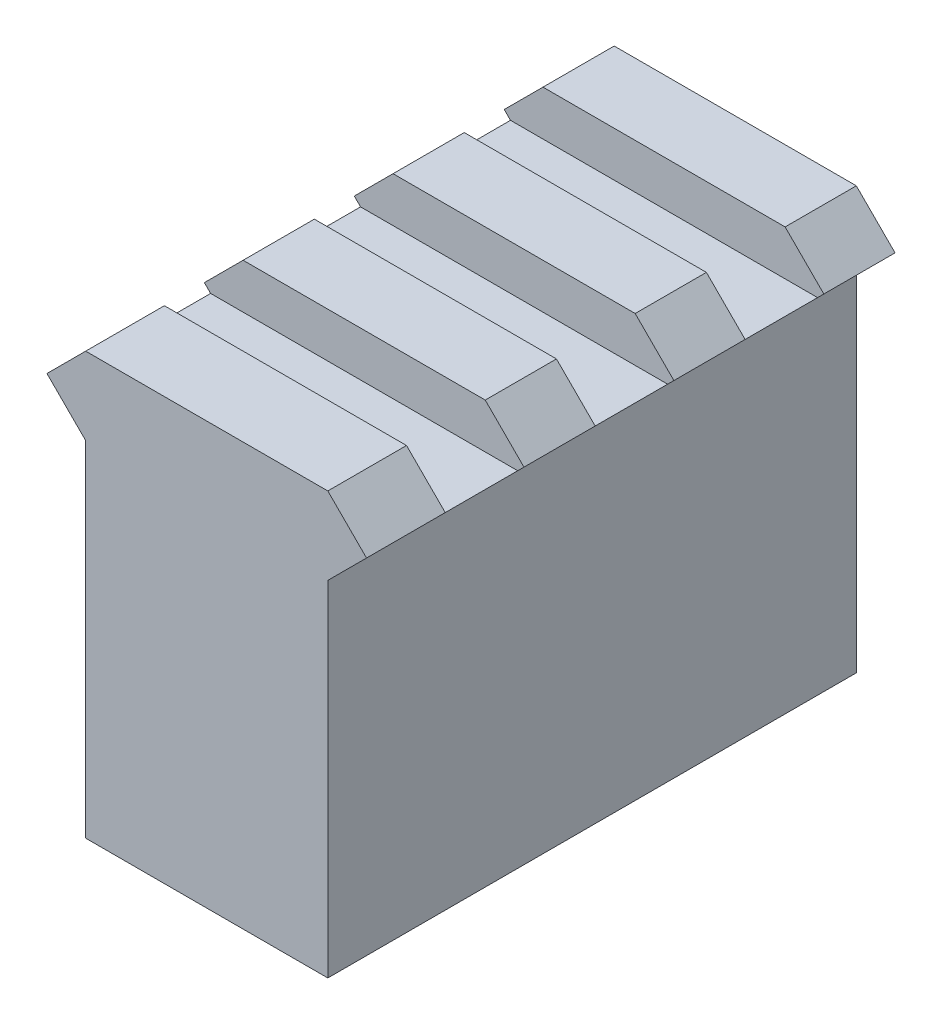
ISO-10303-21;
HEADER;
FILE_DESCRIPTION(('STEP AP214'),'2;1');
FILE_NAME('part.step','',(''),(''),'','','');
FILE_SCHEMA(('AUTOMOTIVE_DESIGN { 1 0 10303 214 1 1 1 1 }'));
ENDSEC;
DATA;
#1=APPLICATION_CONTEXT('core data for automotive mechanical design processes');
#2=APPLICATION_PROTOCOL_DEFINITION('international standard','automotive_design',2000,#1);
#3=PRODUCT_CONTEXT('',#1,'mechanical');
#4=PRODUCT('Part','Part','',(#3));
#5=PRODUCT_RELATED_PRODUCT_CATEGORY('part','',(#4));
#6=PRODUCT_DEFINITION_FORMATION('','',#4);
#7=PRODUCT_DEFINITION_CONTEXT('part definition',#1,'design');
#8=PRODUCT_DEFINITION('design','',#6,#7);
#9=PRODUCT_DEFINITION_SHAPE('','',#8);
#10=(LENGTH_UNIT() NAMED_UNIT(*) SI_UNIT(.MILLI.,.METRE.));
#11=(NAMED_UNIT(*) PLANE_ANGLE_UNIT() SI_UNIT($,.RADIAN.));
#12=(NAMED_UNIT(*) SI_UNIT($,.STERADIAN.) SOLID_ANGLE_UNIT());
#13=UNCERTAINTY_MEASURE_WITH_UNIT(LENGTH_MEASURE(1.E-05),#10,'distance_accuracy_value','');
#14=(GEOMETRIC_REPRESENTATION_CONTEXT(3) GLOBAL_UNCERTAINTY_ASSIGNED_CONTEXT((#13)) GLOBAL_UNIT_ASSIGNED_CONTEXT((#10,
#11,#12)) REPRESENTATION_CONTEXT('',''));
#15=CARTESIAN_POINT('',(0.,0.,0.));
#16=DIRECTION('',(0.,0.,1.));
#17=DIRECTION('',(1.,0.,0.));
#18=AXIS2_PLACEMENT_3D('',#15,#16,#17);
#19=CARTESIAN_POINT('',(10.6576195301772,25.55,35.25));
#20=DIRECTION('',(-0.707106781186549,-0.707106781186546,0.));
#21=DIRECTION('',(0.707106781186546,-0.707106781186549,0.));
#22=AXIS2_PLACEMENT_3D('',#19,#20,#21);
#23=PLANE('',#22);
#24=DIRECTION('',(-0.707106781186546,0.707106781186549,0.));
#25=VECTOR('',#24,1.);
#26=CARTESIAN_POINT('',(10.6576195301772,25.55,4.75));
#27=LINE('',#26,#25);
#28=CARTESIAN_POINT('',(10.6576195301772,25.55,4.75));
#29=VERTEX_POINT('',#28);
#30=CARTESIAN_POINT('',(8.07481953017716,28.1328,4.75));
#31=VERTEX_POINT('',#30);
#32=EDGE_CURVE('E305',#29,#31,#27,.T.);
#33=ORIENTED_EDGE('',*,*,#32,.F.);
#34=DIRECTION('',(0.,0.,-1.));
#35=VECTOR('',#34,1.);
#36=CARTESIAN_POINT('',(10.6576195301772,25.55,35.25));
#37=LINE('',#36,#35);
#38=CARTESIAN_POINT('',(10.6576195301772,25.55,0.));
#39=VERTEX_POINT('',#38);
#40=EDGE_CURVE('E362',#29,#39,#37,.T.);
#41=ORIENTED_EDGE('',*,*,#40,.T.);
#42=DIRECTION('',(-0.707106781186546,0.707106781186549,0.));
#43=VECTOR('',#42,1.);
#44=CARTESIAN_POINT('',(10.6576195301772,25.55,0.));
#45=LINE('',#44,#43);
#46=CARTESIAN_POINT('',(8.07481953017716,28.1328,0.));
#47=VERTEX_POINT('',#46);
#48=EDGE_CURVE('E332',#39,#47,#45,.T.);
#49=ORIENTED_EDGE('',*,*,#48,.T.);
#50=DIRECTION('',(0.,0.,-1.));
#51=VECTOR('',#50,1.);
#52=CARTESIAN_POINT('',(8.07481953017716,28.1328,35.25));
#53=LINE('',#52,#51);
#54=EDGE_CURVE('E421',#31,#47,#53,.T.);
#55=ORIENTED_EDGE('',*,*,#54,.F.);
#56=EDGE_LOOP('',(#33,#41,#49,#55));
#57=FACE_BOUND('',#56,.T.);
#58=ADVANCED_FACE('F39',(#57),#23,.F.);
#59=DIRECTION('',(-0.707106781186546,0.707106781186549,0.));
#60=VECTOR('',#59,1.);
#61=CARTESIAN_POINT('',(10.6576195301772,25.55,24.75));
#62=LINE('',#61,#60);
#63=CARTESIAN_POINT('',(10.6576195301772,25.55,24.75));
#64=VERTEX_POINT('',#63);
#65=CARTESIAN_POINT('',(8.07481953017716,28.1328,24.75));
#66=VERTEX_POINT('',#65);
#67=EDGE_CURVE('E281',#64,#66,#62,.T.);
#68=ORIENTED_EDGE('',*,*,#67,.F.);
#69=CARTESIAN_POINT('',(10.6576195301772,25.55,20.));
#70=VERTEX_POINT('',#69);
#71=EDGE_CURVE('E396',#64,#70,#37,.T.);
#72=ORIENTED_EDGE('',*,*,#71,.T.);
#73=DIRECTION('',(-0.707106781186546,0.707106781186549,0.));
#74=VECTOR('',#73,1.);
#75=CARTESIAN_POINT('',(10.6576195301772,25.55,20.));
#76=LINE('',#75,#74);
#77=CARTESIAN_POINT('',(8.07481953017716,28.1328,20.));
#78=VERTEX_POINT('',#77);
#79=EDGE_CURVE('E248',#70,#78,#76,.T.);
#80=ORIENTED_EDGE('',*,*,#79,.T.);
#81=EDGE_CURVE('E427',#66,#78,#53,.T.);
#82=ORIENTED_EDGE('',*,*,#81,.F.);
#83=EDGE_LOOP('',(#68,#72,#80,#82));
#84=FACE_BOUND('',#83,.T.);
#85=ADVANCED_FACE('F504',(#84),#23,.F.);
#86=CARTESIAN_POINT('',(10.6576195301772,25.55,14.75));
#87=VERTEX_POINT('',#86);
#88=CARTESIAN_POINT('',(10.6576195301772,25.55,10.));
#89=VERTEX_POINT('',#88);
#90=EDGE_CURVE('E457',#87,#89,#37,.T.);
#91=ORIENTED_EDGE('',*,*,#90,.T.);
#92=DIRECTION('',(-0.707106781186546,0.707106781186549,0.));
#93=VECTOR('',#92,1.);
#94=CARTESIAN_POINT('',(10.6576195301772,25.55,10.));
#95=LINE('',#94,#93);
#96=CARTESIAN_POINT('',(8.07481953017716,28.1328,10.));
#97=VERTEX_POINT('',#96);
#98=EDGE_CURVE('E295',#89,#97,#95,.T.);
#99=ORIENTED_EDGE('',*,*,#98,.T.);
#100=CARTESIAN_POINT('',(8.07481953017716,28.1328,14.75));
#101=VERTEX_POINT('',#100);
#102=EDGE_CURVE('E487',#101,#97,#53,.T.);
#103=ORIENTED_EDGE('',*,*,#102,.F.);
#104=DIRECTION('',(-0.707106781186546,0.707106781186549,0.));
#105=VECTOR('',#104,1.);
#106=CARTESIAN_POINT('',(10.6576195301772,25.55,14.75));
#107=LINE('',#106,#105);
#108=EDGE_CURVE('E230',#87,#101,#107,.T.);
#109=ORIENTED_EDGE('',*,*,#108,.F.);
#110=EDGE_LOOP('',(#91,#99,#103,#109));
#111=FACE_BOUND('',#110,.T.);
#112=ADVANCED_FACE('F461',(#111),#23,.F.);
#113=CARTESIAN_POINT('',(8.07481953017716,28.1328,35.25));
#114=DIRECTION('',(0.,-1.,0.));
#115=DIRECTION('',(0.,0.,-1.));
#116=AXIS2_PLACEMENT_3D('',#113,#114,#115);
#117=PLANE('',#116);
#118=DIRECTION('',(1.,0.,0.));
#119=VECTOR('',#118,1.);
#120=CARTESIAN_POINT('',(-14.3150473396328,28.1328,4.75));
#121=LINE('',#120,#119);
#122=CARTESIAN_POINT('',(-8.07481953017716,28.1328,4.75));
#123=VERTEX_POINT('',#122);
#124=EDGE_CURVE('E485',#123,#31,#121,.T.);
#125=ORIENTED_EDGE('',*,*,#124,.T.);
#126=ORIENTED_EDGE('',*,*,#54,.T.);
#127=DIRECTION('',(-1.,0.,0.));
#128=VECTOR('',#127,1.);
#129=CARTESIAN_POINT('',(8.07481953017716,28.1328,0.));
#130=LINE('',#129,#128);
#131=CARTESIAN_POINT('',(-8.07481953017716,28.1328,0.));
#132=VERTEX_POINT('',#131);
#133=EDGE_CURVE('E366',#47,#132,#130,.T.);
#134=ORIENTED_EDGE('',*,*,#133,.T.);
#135=DIRECTION('',(0.,0.,-1.));
#136=VECTOR('',#135,1.);
#137=CARTESIAN_POINT('',(-8.07481953017716,28.1328,35.25));
#138=LINE('',#137,#136);
#139=EDGE_CURVE('E415',#123,#132,#138,.T.);
#140=ORIENTED_EDGE('',*,*,#139,.F.);
#141=EDGE_LOOP('',(#125,#126,#134,#140));
#142=FACE_BOUND('',#141,.T.);
#143=ADVANCED_FACE('F484',(#142),#117,.F.);
#144=DIRECTION('',(1.,0.,0.));
#145=VECTOR('',#144,1.);
#146=CARTESIAN_POINT('',(0.,28.1328,24.75));
#147=LINE('',#146,#145);
#148=CARTESIAN_POINT('',(-8.07481953017716,28.1328,24.75));
#149=VERTEX_POINT('',#148);
#150=EDGE_CURVE('E501',#149,#66,#147,.T.);
#151=ORIENTED_EDGE('',*,*,#150,.T.);
#152=ORIENTED_EDGE('',*,*,#81,.T.);
#153=DIRECTION('',(1.,0.,0.));
#154=VECTOR('',#153,1.);
#155=CARTESIAN_POINT('',(0.,28.1328,20.));
#156=LINE('',#155,#154);
#157=CARTESIAN_POINT('',(-8.07481953017716,28.1328,20.));
#158=VERTEX_POINT('',#157);
#159=EDGE_CURVE('E240',#158,#78,#156,.T.);
#160=ORIENTED_EDGE('',*,*,#159,.F.);
#161=EDGE_CURVE('E422',#149,#158,#138,.T.);
#162=ORIENTED_EDGE('',*,*,#161,.F.);
#163=EDGE_LOOP('',(#151,#152,#160,#162));
#164=FACE_BOUND('',#163,.T.);
#165=ADVANCED_FACE('F498',(#164),#117,.F.);
#166=ORIENTED_EDGE('',*,*,#102,.T.);
#167=DIRECTION('',(1.,0.,0.));
#168=VECTOR('',#167,1.);
#169=CARTESIAN_POINT('',(-14.3150473396328,28.1328,10.));
#170=LINE('',#169,#168);
#171=CARTESIAN_POINT('',(-8.07481953017716,28.1328,10.));
#172=VERTEX_POINT('',#171);
#173=EDGE_CURVE('E525',#172,#97,#170,.T.);
#174=ORIENTED_EDGE('',*,*,#173,.F.);
#175=CARTESIAN_POINT('',(-8.07481953017716,28.1328,14.75));
#176=VERTEX_POINT('',#175);
#177=EDGE_CURVE('E514',#176,#172,#138,.T.);
#178=ORIENTED_EDGE('',*,*,#177,.F.);
#179=DIRECTION('',(1.,0.,0.));
#180=VECTOR('',#179,1.);
#181=CARTESIAN_POINT('',(0.,28.1328,14.75));
#182=LINE('',#181,#180);
#183=EDGE_CURVE('E510',#176,#101,#182,.T.);
#184=ORIENTED_EDGE('',*,*,#183,.T.);
#185=EDGE_LOOP('',(#166,#174,#178,#184));
#186=FACE_BOUND('',#185,.T.);
#187=ADVANCED_FACE('F512',(#186),#117,.F.);
#188=CARTESIAN_POINT('',(-10.6576195301772,25.55,35.25));
#189=DIRECTION('',(-0.707106781186549,0.707106781186546,0.));
#190=DIRECTION('',(-0.707106781186546,-0.707106781186549,0.));
#191=AXIS2_PLACEMENT_3D('',#188,#189,#190);
#192=PLANE('',#191);
#193=DIRECTION('',(0.,0.,-1.));
#194=VECTOR('',#193,1.);
#195=CARTESIAN_POINT('',(-10.6576195301772,25.55,35.25));
#196=LINE('',#195,#194);
#197=CARTESIAN_POINT('',(-10.6576195301772,25.55,4.75));
#198=VERTEX_POINT('',#197);
#199=CARTESIAN_POINT('',(-10.6576195301772,25.55,0.));
#200=VERTEX_POINT('',#199);
#201=EDGE_CURVE('E410',#198,#200,#196,.T.);
#202=ORIENTED_EDGE('',*,*,#201,.F.);
#203=DIRECTION('',(0.707106781186546,0.707106781186549,0.));
#204=VECTOR('',#203,1.);
#205=CARTESIAN_POINT('',(-10.6576195301772,25.55,4.75));
#206=LINE('',#205,#204);
#207=EDGE_CURVE('E312',#198,#123,#206,.T.);
#208=ORIENTED_EDGE('',*,*,#207,.T.);
#209=ORIENTED_EDGE('',*,*,#139,.T.);
#210=DIRECTION('',(0.707106781186546,0.707106781186549,0.));
#211=VECTOR('',#210,1.);
#212=CARTESIAN_POINT('',(-10.6576195301772,25.55,0.));
#213=LINE('',#212,#211);
#214=EDGE_CURVE('E370',#200,#132,#213,.T.);
#215=ORIENTED_EDGE('',*,*,#214,.F.);
#216=EDGE_LOOP('',(#202,#208,#209,#215));
#217=FACE_BOUND('',#216,.T.);
#218=ADVANCED_FACE('F575',(#217),#192,.T.);
#219=CARTESIAN_POINT('',(-10.6576195301772,25.55,24.75));
#220=VERTEX_POINT('',#219);
#221=CARTESIAN_POINT('',(-10.6576195301772,25.55,20.));
#222=VERTEX_POINT('',#221);
#223=EDGE_CURVE('E416',#220,#222,#196,.T.);
#224=ORIENTED_EDGE('',*,*,#223,.F.);
#225=DIRECTION('',(0.707106781186546,0.707106781186549,0.));
#226=VECTOR('',#225,1.);
#227=CARTESIAN_POINT('',(-10.6576195301772,25.55,24.75));
#228=LINE('',#227,#226);
#229=EDGE_CURVE('E288',#220,#149,#228,.T.);
#230=ORIENTED_EDGE('',*,*,#229,.T.);
#231=ORIENTED_EDGE('',*,*,#161,.T.);
#232=DIRECTION('',(0.707106781186546,0.707106781186549,0.));
#233=VECTOR('',#232,1.);
#234=CARTESIAN_POINT('',(-10.6576195301772,25.55,20.));
#235=LINE('',#234,#233);
#236=EDGE_CURVE('E260',#222,#158,#235,.T.);
#237=ORIENTED_EDGE('',*,*,#236,.F.);
#238=EDGE_LOOP('',(#224,#230,#231,#237));
#239=FACE_BOUND('',#238,.T.);
#240=ADVANCED_FACE('F584',(#239),#192,.T.);
#241=DIRECTION('',(0.707106781186546,0.707106781186549,0.));
#242=VECTOR('',#241,1.);
#243=CARTESIAN_POINT('',(-10.6576195301772,25.55,10.));
#244=LINE('',#243,#242);
#245=CARTESIAN_POINT('',(-10.6576195301772,25.55,10.));
#246=VERTEX_POINT('',#245);
#247=EDGE_CURVE('E302',#246,#172,#244,.T.);
#248=ORIENTED_EDGE('',*,*,#247,.F.);
#249=CARTESIAN_POINT('',(-10.6576195301772,25.55,14.75));
#250=VERTEX_POINT('',#249);
#251=EDGE_CURVE('E574',#250,#246,#196,.T.);
#252=ORIENTED_EDGE('',*,*,#251,.F.);
#253=DIRECTION('',(0.707106781186546,0.707106781186549,0.));
#254=VECTOR('',#253,1.);
#255=CARTESIAN_POINT('',(-10.6576195301772,25.55,14.75));
#256=LINE('',#255,#254);
#257=EDGE_CURVE('E224',#250,#176,#256,.T.);
#258=ORIENTED_EDGE('',*,*,#257,.T.);
#259=ORIENTED_EDGE('',*,*,#177,.T.);
#260=EDGE_LOOP('',(#248,#252,#258,#259));
#261=FACE_BOUND('',#260,.T.);
#262=ADVANCED_FACE('F591',(#261),#192,.T.);
#263=CARTESIAN_POINT('',(-8.07481953017716,22.9672,35.25));
#264=DIRECTION('',(-0.707106781186546,-0.707106781186549,0.));
#265=DIRECTION('',(0.707106781186549,-0.707106781186546,0.));
#266=AXIS2_PLACEMENT_3D('',#263,#264,#265);
#267=PLANE('',#266);
#268=DIRECTION('',(0.,0.,1.));
#269=VECTOR('',#268,1.);
#270=CARTESIAN_POINT('',(-10.2404195301772,25.1328,35.25));
#271=LINE('',#270,#269);
#272=CARTESIAN_POINT('',(-10.2404195301772,25.1328,4.75));
#273=VERTEX_POINT('',#272);
#274=CARTESIAN_POINT('',(-10.2404195301772,25.1328,10.));
#275=VERTEX_POINT('',#274);
#276=EDGE_CURVE('E292',#273,#275,#271,.T.);
#277=ORIENTED_EDGE('',*,*,#276,.F.);
#278=DIRECTION('',(-0.707106781186549,0.707106781186546,0.));
#279=VECTOR('',#278,1.);
#280=CARTESIAN_POINT('',(-8.07481953017716,22.9672,4.75));
#281=LINE('',#280,#279);
#282=EDGE_CURVE('E308',#273,#198,#281,.T.);
#283=ORIENTED_EDGE('',*,*,#282,.T.);
#284=ORIENTED_EDGE('',*,*,#201,.T.);
#285=DIRECTION('',(-0.707106781186549,0.707106781186546,0.));
#286=VECTOR('',#285,1.);
#287=CARTESIAN_POINT('',(-8.07481953017716,22.9672,0.));
#288=LINE('',#287,#286);
#289=CARTESIAN_POINT('',(-8.07481953017716,22.9672,0.));
#290=VERTEX_POINT('',#289);
#291=EDGE_CURVE('E374',#290,#200,#288,.T.);
#292=ORIENTED_EDGE('',*,*,#291,.F.);
#293=DIRECTION('',(0.,0.,-1.));
#294=VECTOR('',#293,1.);
#295=CARTESIAN_POINT('',(-8.07481953017716,22.9672,35.25));
#296=LINE('',#295,#294);
#297=CARTESIAN_POINT('',(-8.07481953017716,22.9672,35.25));
#298=VERTEX_POINT('',#297);
#299=EDGE_CURVE('E407',#298,#290,#296,.T.);
#300=ORIENTED_EDGE('',*,*,#299,.F.);
#301=DIRECTION('',(-0.707106781186549,0.707106781186546,0.));
#302=VECTOR('',#301,1.);
#303=CARTESIAN_POINT('',(-8.07481953017716,22.9672,35.25));
#304=LINE('',#303,#302);
#305=CARTESIAN_POINT('',(-10.6576195301772,25.55,35.25));
#306=VERTEX_POINT('',#305);
#307=EDGE_CURVE('E345',#298,#306,#304,.T.);
#308=ORIENTED_EDGE('',*,*,#307,.T.);
#309=CARTESIAN_POINT('',(-10.6576195301772,25.55,30.));
#310=VERTEX_POINT('',#309);
#311=EDGE_CURVE('E411',#306,#310,#196,.T.);
#312=ORIENTED_EDGE('',*,*,#311,.T.);
#313=DIRECTION('',(-0.707106781186549,0.707106781186546,0.));
#314=VECTOR('',#313,1.);
#315=CARTESIAN_POINT('',(-8.07481953017716,22.9672,30.));
#316=LINE('',#315,#314);
#317=CARTESIAN_POINT('',(-10.2404195301772,25.1328,30.));
#318=VERTEX_POINT('',#317);
#319=EDGE_CURVE('E275',#318,#310,#316,.T.);
#320=ORIENTED_EDGE('',*,*,#319,.F.);
#321=DIRECTION('',(0.,0.,-1.));
#322=VECTOR('',#321,1.);
#323=CARTESIAN_POINT('',(-10.2404195301772,25.1328,35.25));
#324=LINE('',#323,#322);
#325=CARTESIAN_POINT('',(-10.2404195301772,25.1328,24.75));
#326=VERTEX_POINT('',#325);
#327=EDGE_CURVE('E267',#318,#326,#324,.T.);
#328=ORIENTED_EDGE('',*,*,#327,.T.);
#329=DIRECTION('',(-0.707106781186549,0.707106781186546,0.));
#330=VECTOR('',#329,1.);
#331=CARTESIAN_POINT('',(-8.07481953017716,22.9672,24.75));
#332=LINE('',#331,#330);
#333=EDGE_CURVE('E284',#326,#220,#332,.T.);
#334=ORIENTED_EDGE('',*,*,#333,.T.);
#335=ORIENTED_EDGE('',*,*,#223,.T.);
#336=DIRECTION('',(-0.707106781186549,0.707106781186546,0.));
#337=VECTOR('',#336,1.);
#338=CARTESIAN_POINT('',(-8.07481953017716,22.9672,20.));
#339=LINE('',#338,#337);
#340=CARTESIAN_POINT('',(-10.2404195301772,25.1328,20.));
#341=VERTEX_POINT('',#340);
#342=EDGE_CURVE('E246',#341,#222,#339,.T.);
#343=ORIENTED_EDGE('',*,*,#342,.F.);
#344=DIRECTION('',(0.,0.,-1.));
#345=VECTOR('',#344,1.);
#346=CARTESIAN_POINT('',(-10.2404195301772,25.1328,35.25));
#347=LINE('',#346,#345);
#348=CARTESIAN_POINT('',(-10.2404195301772,25.1328,14.75));
#349=VERTEX_POINT('',#348);
#350=EDGE_CURVE('E234',#341,#349,#347,.T.);
#351=ORIENTED_EDGE('',*,*,#350,.T.);
#352=DIRECTION('',(-0.707106781186549,0.707106781186546,0.));
#353=VECTOR('',#352,1.);
#354=CARTESIAN_POINT('',(-8.07481953017716,22.9672,14.75));
#355=LINE('',#354,#353);
#356=EDGE_CURVE('E218',#349,#250,#355,.T.);
#357=ORIENTED_EDGE('',*,*,#356,.T.);
#358=ORIENTED_EDGE('',*,*,#251,.T.);
#359=DIRECTION('',(-0.707106781186549,0.707106781186546,0.));
#360=VECTOR('',#359,1.);
#361=CARTESIAN_POINT('',(-8.07481953017716,22.9672,10.));
#362=LINE('',#361,#360);
#363=EDGE_CURVE('E299',#275,#246,#362,.T.);
#364=ORIENTED_EDGE('',*,*,#363,.F.);
#365=EDGE_LOOP('',(#277,#283,#284,#292,#300,#308,#312,#320,#328,#334,#335,#343,#351,#357,#358,#364));
#366=FACE_BOUND('',#365,.T.);
#367=ADVANCED_FACE('F244',(#366),#267,.T.);
#368=CARTESIAN_POINT('',(8.07481953017716,22.9672,35.25));
#369=DIRECTION('',(-0.707106781186546,0.707106781186549,0.));
#370=DIRECTION('',(-0.707106781186549,-0.707106781186546,0.));
#371=AXIS2_PLACEMENT_3D('',#368,#369,#370);
#372=PLANE('',#371);
#373=DIRECTION('',(0.707106781186549,0.707106781186546,0.));
#374=VECTOR('',#373,1.);
#375=CARTESIAN_POINT('',(8.07481953017716,22.9672,4.75));
#376=LINE('',#375,#374);
#377=CARTESIAN_POINT('',(10.2404195301772,25.1328,4.75));
#378=VERTEX_POINT('',#377);
#379=EDGE_CURVE('E11',#378,#29,#376,.T.);
#380=ORIENTED_EDGE('',*,*,#379,.F.);
#381=DIRECTION('',(0.,0.,1.));
#382=VECTOR('',#381,1.);
#383=CARTESIAN_POINT('',(10.2404195301772,25.1328,35.25));
#384=LINE('',#383,#382);
#385=CARTESIAN_POINT('',(10.2404195301772,25.1328,10.));
#386=VERTEX_POINT('',#385);
#387=EDGE_CURVE('E447',#378,#386,#384,.T.);
#388=ORIENTED_EDGE('',*,*,#387,.T.);
#389=DIRECTION('',(0.707106781186549,0.707106781186546,0.));
#390=VECTOR('',#389,1.);
#391=CARTESIAN_POINT('',(8.07481953017716,22.9672,10.));
#392=LINE('',#391,#390);
#393=EDGE_CURVE('E48',#386,#89,#392,.T.);
#394=ORIENTED_EDGE('',*,*,#393,.T.);
#395=ORIENTED_EDGE('',*,*,#90,.F.);
#396=DIRECTION('',(0.707106781186549,0.707106781186546,0.));
#397=VECTOR('',#396,1.);
#398=CARTESIAN_POINT('',(8.07481953017716,22.9672,14.75));
#399=LINE('',#398,#397);
#400=CARTESIAN_POINT('',(10.2404195301772,25.1328,14.75));
#401=VERTEX_POINT('',#400);
#402=EDGE_CURVE('E434',#401,#87,#399,.T.);
#403=ORIENTED_EDGE('',*,*,#402,.F.);
#404=DIRECTION('',(0.,0.,-1.));
#405=VECTOR('',#404,1.);
#406=CARTESIAN_POINT('',(10.2404195301772,25.1328,35.25));
#407=LINE('',#406,#405);
#408=CARTESIAN_POINT('',(10.2404195301772,25.1328,20.));
#409=VERTEX_POINT('',#408);
#410=EDGE_CURVE('E237',#409,#401,#407,.T.);
#411=ORIENTED_EDGE('',*,*,#410,.F.);
#412=DIRECTION('',(0.707106781186549,0.707106781186546,0.));
#413=VECTOR('',#412,1.);
#414=CARTESIAN_POINT('',(8.07481953017716,22.9672,20.));
#415=LINE('',#414,#413);
#416=EDGE_CURVE('E430',#409,#70,#415,.T.);
#417=ORIENTED_EDGE('',*,*,#416,.T.);
#418=ORIENTED_EDGE('',*,*,#71,.F.);
#419=DIRECTION('',(0.707106781186549,0.707106781186546,0.));
#420=VECTOR('',#419,1.);
#421=CARTESIAN_POINT('',(8.07481953017716,22.9672,24.75));
#422=LINE('',#421,#420);
#423=CARTESIAN_POINT('',(10.2404195301772,25.1328,24.75));
#424=VERTEX_POINT('',#423);
#425=EDGE_CURVE('E444',#424,#64,#422,.T.);
#426=ORIENTED_EDGE('',*,*,#425,.F.);
#427=DIRECTION('',(0.,0.,-1.));
#428=VECTOR('',#427,1.);
#429=CARTESIAN_POINT('',(10.2404195301772,25.1328,35.25));
#430=LINE('',#429,#428);
#431=CARTESIAN_POINT('',(10.2404195301772,25.1328,30.));
#432=VERTEX_POINT('',#431);
#433=EDGE_CURVE('E437',#432,#424,#430,.T.);
#434=ORIENTED_EDGE('',*,*,#433,.F.);
#435=DIRECTION('',(0.707106781186549,0.707106781186546,0.));
#436=VECTOR('',#435,1.);
#437=CARTESIAN_POINT('',(8.07481953017716,22.9672,30.));
#438=LINE('',#437,#436);
#439=CARTESIAN_POINT('',(10.6576195301772,25.55,30.));
#440=VERTEX_POINT('',#439);
#441=EDGE_CURVE('E440',#432,#440,#438,.T.);
#442=ORIENTED_EDGE('',*,*,#441,.T.);
#443=CARTESIAN_POINT('',(10.6576195301772,25.55,35.25));
#444=VERTEX_POINT('',#443);
#445=EDGE_CURVE('E391',#444,#440,#37,.T.);
#446=ORIENTED_EDGE('',*,*,#445,.F.);
#447=DIRECTION('',(0.707106781186549,0.707106781186546,0.));
#448=VECTOR('',#447,1.);
#449=CARTESIAN_POINT('',(8.07481953017716,22.9672,35.25));
#450=LINE('',#449,#448);
#451=CARTESIAN_POINT('',(8.07481953017716,22.9672,35.25));
#452=VERTEX_POINT('',#451);
#453=EDGE_CURVE('E359',#452,#444,#450,.T.);
#454=ORIENTED_EDGE('',*,*,#453,.F.);
#455=DIRECTION('',(0.,0.,-1.));
#456=VECTOR('',#455,1.);
#457=CARTESIAN_POINT('',(8.07481953017716,22.9672,35.25));
#458=LINE('',#457,#456);
#459=CARTESIAN_POINT('',(8.07481953017716,22.9672,0.));
#460=VERTEX_POINT('',#459);
#461=EDGE_CURVE('E395',#452,#460,#458,.T.);
#462=ORIENTED_EDGE('',*,*,#461,.T.);
#463=DIRECTION('',(0.707106781186549,0.707106781186546,0.));
#464=VECTOR('',#463,1.);
#465=CARTESIAN_POINT('',(8.07481953017716,22.9672,0.));
#466=LINE('',#465,#464);
#467=EDGE_CURVE('E338',#460,#39,#466,.T.);
#468=ORIENTED_EDGE('',*,*,#467,.T.);
#469=ORIENTED_EDGE('',*,*,#40,.F.);
#470=EDGE_LOOP('',(#380,#388,#394,#395,#403,#411,#417,#418,#426,#434,#442,#446,#454,#462,#468,#469));
#471=FACE_BOUND('',#470,.T.);
#472=ADVANCED_FACE('F456',(#471),#372,.F.);
#473=ORIENTED_EDGE('',*,*,#445,.T.);
#474=DIRECTION('',(-0.707106781186546,0.707106781186549,0.));
#475=VECTOR('',#474,1.);
#476=CARTESIAN_POINT('',(10.6576195301772,25.55,30.));
#477=LINE('',#476,#475);
#478=CARTESIAN_POINT('',(8.07481953017716,28.1328,30.));
#479=VERTEX_POINT('',#478);
#480=EDGE_CURVE('E271',#440,#479,#477,.T.);
#481=ORIENTED_EDGE('',*,*,#480,.T.);
#482=CARTESIAN_POINT('',(8.07481953017716,28.1328,35.25));
#483=VERTEX_POINT('',#482);
#484=EDGE_CURVE('E423',#483,#479,#53,.T.);
#485=ORIENTED_EDGE('',*,*,#484,.F.);
#486=DIRECTION('',(-0.707106781186546,0.707106781186549,0.));
#487=VECTOR('',#486,1.);
#488=CARTESIAN_POINT('',(10.6576195301772,25.55,35.25));
#489=LINE('',#488,#487);
#490=EDGE_CURVE('E333',#444,#483,#489,.T.);
#491=ORIENTED_EDGE('',*,*,#490,.F.);
#492=EDGE_LOOP('',(#473,#481,#485,#491));
#493=FACE_BOUND('',#492,.T.);
#494=ADVANCED_FACE('F41',(#493),#23,.F.);
#495=ORIENTED_EDGE('',*,*,#484,.T.);
#496=DIRECTION('',(1.,0.,0.));
#497=VECTOR('',#496,1.);
#498=CARTESIAN_POINT('',(0.,28.1328,30.));
#499=LINE('',#498,#497);
#500=CARTESIAN_POINT('',(-8.07481953017716,28.1328,30.));
#501=VERTEX_POINT('',#500);
#502=EDGE_CURVE('E518',#501,#479,#499,.T.);
#503=ORIENTED_EDGE('',*,*,#502,.F.);
#504=CARTESIAN_POINT('',(-8.07481953017716,28.1328,35.25));
#505=VERTEX_POINT('',#504);
#506=EDGE_CURVE('E417',#505,#501,#138,.T.);
#507=ORIENTED_EDGE('',*,*,#506,.F.);
#508=DIRECTION('',(-1.,0.,0.));
#509=VECTOR('',#508,1.);
#510=CARTESIAN_POINT('',(8.07481953017716,28.1328,35.25));
#511=LINE('',#510,#509);
#512=EDGE_CURVE('E337',#483,#505,#511,.T.);
#513=ORIENTED_EDGE('',*,*,#512,.F.);
#514=EDGE_LOOP('',(#495,#503,#507,#513));
#515=FACE_BOUND('',#514,.T.);
#516=ADVANCED_FACE('F549',(#515),#117,.F.);
#517=DIRECTION('',(0.707106781186546,0.707106781186549,0.));
#518=VECTOR('',#517,1.);
#519=CARTESIAN_POINT('',(-10.6576195301772,25.55,30.));
#520=LINE('',#519,#518);
#521=EDGE_CURVE('E278',#310,#501,#520,.T.);
#522=ORIENTED_EDGE('',*,*,#521,.F.);
#523=ORIENTED_EDGE('',*,*,#311,.F.);
#524=DIRECTION('',(0.707106781186546,0.707106781186549,0.));
#525=VECTOR('',#524,1.);
#526=CARTESIAN_POINT('',(-10.6576195301772,25.55,35.25));
#527=LINE('',#526,#525);
#528=EDGE_CURVE('E341',#306,#505,#527,.T.);
#529=ORIENTED_EDGE('',*,*,#528,.T.);
#530=ORIENTED_EDGE('',*,*,#506,.T.);
#531=EDGE_LOOP('',(#522,#523,#529,#530));
#532=FACE_BOUND('',#531,.T.);
#533=ADVANCED_FACE('F558',(#532),#192,.T.);
#534=CARTESIAN_POINT('',(-8.07481953017716,0.,35.25));
#535=DIRECTION('',(-1.,0.,0.));
#536=DIRECTION('',(0.,0.,1.));
#537=AXIS2_PLACEMENT_3D('',#534,#535,#536);
#538=PLANE('',#537);
#539=DIRECTION('',(0.,1.,0.));
#540=VECTOR('',#539,1.);
#541=CARTESIAN_POINT('',(-8.07481953017716,0.,0.));
#542=LINE('',#541,#540);
#543=CARTESIAN_POINT('',(-8.07481953017716,0.,0.));
#544=VERTEX_POINT('',#543);
#545=EDGE_CURVE('E378',#544,#290,#542,.T.);
#546=ORIENTED_EDGE('',*,*,#545,.F.);
#547=DIRECTION('',(0.,0.,-1.));
#548=VECTOR('',#547,1.);
#549=CARTESIAN_POINT('',(-8.07481953017716,0.,35.25));
#550=LINE('',#549,#548);
#551=CARTESIAN_POINT('',(-8.07481953017716,0.,35.25));
#552=VERTEX_POINT('',#551);
#553=EDGE_CURVE('E404',#552,#544,#550,.T.);
#554=ORIENTED_EDGE('',*,*,#553,.F.);
#555=DIRECTION('',(0.,1.,0.));
#556=VECTOR('',#555,1.);
#557=CARTESIAN_POINT('',(-8.07481953017716,0.,35.25));
#558=LINE('',#557,#556);
#559=EDGE_CURVE('E349',#552,#298,#558,.T.);
#560=ORIENTED_EDGE('',*,*,#559,.T.);
#561=ORIENTED_EDGE('',*,*,#299,.T.);
#562=EDGE_LOOP('',(#546,#554,#560,#561));
#563=FACE_BOUND('',#562,.T.);
#564=ADVANCED_FACE('F562',(#563),#538,.T.);
#565=CARTESIAN_POINT('',(-8.07481953017716,0.,35.25));
#566=DIRECTION('',(0.,1.,0.));
#567=DIRECTION('',(0.,0.,1.));
#568=AXIS2_PLACEMENT_3D('',#565,#566,#567);
#569=PLANE('',#568);
#570=CARTESIAN_POINT('',(0.,0.,8.25));
#571=DIRECTION('',(0.,-1.,0.));
#572=DIRECTION('',(0.,0.,-1.));
#573=AXIS2_PLACEMENT_3D('',#570,#571,#572);
#574=CIRCLE('',#573,2.5527);
#575=CARTESIAN_POINT('',(0.,0.,5.6973));
#576=VERTEX_POINT('',#575);
#577=EDGE_CURVE('E316',#576,#576,#574,.T.);
#578=ORIENTED_EDGE('',*,*,#577,.F.);
#579=EDGE_LOOP('',(#578));
#580=FACE_BOUND('',#579,.T.);
#581=CARTESIAN_POINT('',(0.,0.,28.25));
#582=DIRECTION('',(0.,-1.,0.));
#583=DIRECTION('',(0.,0.,-1.));
#584=AXIS2_PLACEMENT_3D('',#581,#582,#583);
#585=CIRCLE('',#584,2.5527);
#586=CARTESIAN_POINT('',(0.,0.,25.6973));
#587=VERTEX_POINT('',#586);
#588=EDGE_CURVE('E324',#587,#587,#585,.T.);
#589=ORIENTED_EDGE('',*,*,#588,.F.);
#590=EDGE_LOOP('',(#589));
#591=FACE_BOUND('',#590,.T.);
#592=DIRECTION('',(1.,0.,0.));
#593=VECTOR('',#592,1.);
#594=CARTESIAN_POINT('',(-8.07481953017716,0.,0.));
#595=LINE('',#594,#593);
#596=CARTESIAN_POINT('',(8.07481953017716,0.,0.));
#597=VERTEX_POINT('',#596);
#598=EDGE_CURVE('E382',#544,#597,#595,.T.);
#599=ORIENTED_EDGE('',*,*,#598,.T.);
#600=DIRECTION('',(0.,0.,-1.));
#601=VECTOR('',#600,1.);
#602=CARTESIAN_POINT('',(8.07481953017716,0.,35.25));
#603=LINE('',#602,#601);
#604=CARTESIAN_POINT('',(8.07481953017716,0.,35.25));
#605=VERTEX_POINT('',#604);
#606=EDGE_CURVE('E400',#605,#597,#603,.T.);
#607=ORIENTED_EDGE('',*,*,#606,.F.);
#608=DIRECTION('',(1.,0.,0.));
#609=VECTOR('',#608,1.);
#610=CARTESIAN_POINT('',(-8.07481953017716,0.,35.25));
#611=LINE('',#610,#609);
#612=EDGE_CURVE('E353',#552,#605,#611,.T.);
#613=ORIENTED_EDGE('',*,*,#612,.F.);
#614=ORIENTED_EDGE('',*,*,#553,.T.);
#615=EDGE_LOOP('',(#599,#607,#613,#614));
#616=FACE_BOUND('',#615,.T.);
#617=ADVANCED_FACE('F568',(#580,#591,#616),#569,.F.);
#618=CARTESIAN_POINT('',(8.07481953017716,0.,35.25));
#619=DIRECTION('',(-1.,0.,0.));
#620=DIRECTION('',(0.,0.,1.));
#621=AXIS2_PLACEMENT_3D('',#618,#619,#620);
#622=PLANE('',#621);
#623=DIRECTION('',(0.,1.,0.));
#624=VECTOR('',#623,1.);
#625=CARTESIAN_POINT('',(8.07481953017716,0.,0.));
#626=LINE('',#625,#624);
#627=EDGE_CURVE('E385',#597,#460,#626,.T.);
#628=ORIENTED_EDGE('',*,*,#627,.T.);
#629=ORIENTED_EDGE('',*,*,#461,.F.);
#630=DIRECTION('',(0.,1.,0.));
#631=VECTOR('',#630,1.);
#632=CARTESIAN_POINT('',(8.07481953017716,0.,35.25));
#633=LINE('',#632,#631);
#634=EDGE_CURVE('E356',#605,#452,#633,.T.);
#635=ORIENTED_EDGE('',*,*,#634,.F.);
#636=ORIENTED_EDGE('',*,*,#606,.T.);
#637=EDGE_LOOP('',(#628,#629,#635,#636));
#638=FACE_BOUND('',#637,.T.);
#639=ADVANCED_FACE('F570',(#638),#622,.F.);
#640=CARTESIAN_POINT('',(0.,0.,35.25));
#641=DIRECTION('',(0.,0.,-1.));
#642=DIRECTION('',(-1.,0.,0.));
#643=AXIS2_PLACEMENT_3D('',#640,#641,#642);
#644=PLANE('',#643);
#645=ORIENTED_EDGE('',*,*,#490,.T.);
#646=ORIENTED_EDGE('',*,*,#512,.T.);
#647=ORIENTED_EDGE('',*,*,#528,.F.);
#648=ORIENTED_EDGE('',*,*,#307,.F.);
#649=ORIENTED_EDGE('',*,*,#559,.F.);
#650=ORIENTED_EDGE('',*,*,#612,.T.);
#651=ORIENTED_EDGE('',*,*,#634,.T.);
#652=ORIENTED_EDGE('',*,*,#453,.T.);
#653=EDGE_LOOP('',(#645,#646,#647,#648,#649,#650,#651,#652));
#654=FACE_BOUND('',#653,.T.);
#655=ADVANCED_FACE('F552',(#654),#644,.F.);
#656=CARTESIAN_POINT('',(0.,0.,0.));
#657=DIRECTION('',(0.,0.,-1.));
#658=DIRECTION('',(-1.,0.,0.));
#659=AXIS2_PLACEMENT_3D('',#656,#657,#658);
#660=PLANE('',#659);
#661=ORIENTED_EDGE('',*,*,#48,.F.);
#662=ORIENTED_EDGE('',*,*,#467,.F.);
#663=ORIENTED_EDGE('',*,*,#627,.F.);
#664=ORIENTED_EDGE('',*,*,#598,.F.);
#665=ORIENTED_EDGE('',*,*,#545,.T.);
#666=ORIENTED_EDGE('',*,*,#291,.T.);
#667=ORIENTED_EDGE('',*,*,#214,.T.);
#668=ORIENTED_EDGE('',*,*,#133,.F.);
#669=EDGE_LOOP('',(#661,#662,#663,#664,#665,#666,#667,#668));
#670=FACE_BOUND('',#669,.T.);
#671=ADVANCED_FACE('F479',(#670),#660,.T.);
#672=CARTESIAN_POINT('',(0.,15.,28.25));
#673=DIRECTION('',(0.,-1.,0.));
#674=DIRECTION('',(0.,0.,-1.));
#675=AXIS2_PLACEMENT_3D('',#672,#673,#674);
#676=CONICAL_SURFACE('',#675,2.5527,1.02974425867665);
#677=CARTESIAN_POINT('',(0.,16.5338169021917,28.25));
#678=VERTEX_POINT('',#677);
#679=VERTEX_LOOP('',#678);
#680=FACE_BOUND('',#679,.T.);
#681=CARTESIAN_POINT('',(0.,15.,28.25));
#682=DIRECTION('',(0.,-1.,0.));
#683=DIRECTION('',(0.,0.,-1.));
#684=AXIS2_PLACEMENT_3D('',#681,#682,#683);
#685=CIRCLE('',#684,2.5527);
#686=CARTESIAN_POINT('',(0.,15.,25.6973));
#687=VERTEX_POINT('',#686);
#688=EDGE_CURVE('E328',#687,#687,#685,.T.);
#689=ORIENTED_EDGE('',*,*,#688,.T.);
#690=EDGE_LOOP('',(#689));
#691=FACE_BOUND('',#690,.T.);
#692=ADVANCED_FACE('F636',(#680,#691),#676,.F.);
#693=CARTESIAN_POINT('',(0.,0.,28.25));
#694=DIRECTION('',(0.,-1.,0.));
#695=DIRECTION('',(0.,0.,-1.));
#696=AXIS2_PLACEMENT_3D('',#693,#694,#695);
#697=CYLINDRICAL_SURFACE('',#696,2.5527);
#698=ORIENTED_EDGE('',*,*,#688,.F.);
#699=EDGE_LOOP('',(#698));
#700=FACE_BOUND('',#699,.T.);
#701=ORIENTED_EDGE('',*,*,#588,.T.);
#702=EDGE_LOOP('',(#701));
#703=FACE_BOUND('',#702,.T.);
#704=ADVANCED_FACE('F641',(#700,#703),#697,.F.);
#705=CARTESIAN_POINT('',(0.,15.,8.25));
#706=DIRECTION('',(0.,-1.,0.));
#707=DIRECTION('',(0.,0.,-1.));
#708=AXIS2_PLACEMENT_3D('',#705,#706,#707);
#709=CONICAL_SURFACE('',#708,2.5527,1.02974425867665);
#710=CARTESIAN_POINT('',(0.,16.5338169021917,8.25));
#711=VERTEX_POINT('',#710);
#712=VERTEX_LOOP('',#711);
#713=FACE_BOUND('',#712,.T.);
#714=CARTESIAN_POINT('',(0.,15.,8.25));
#715=DIRECTION('',(0.,-1.,0.));
#716=DIRECTION('',(0.,0.,-1.));
#717=AXIS2_PLACEMENT_3D('',#714,#715,#716);
#718=CIRCLE('',#717,2.5527);
#719=CARTESIAN_POINT('',(0.,15.,5.6973));
#720=VERTEX_POINT('',#719);
#721=EDGE_CURVE('E320',#720,#720,#718,.T.);
#722=ORIENTED_EDGE('',*,*,#721,.T.);
#723=EDGE_LOOP('',(#722));
#724=FACE_BOUND('',#723,.T.);
#725=ADVANCED_FACE('F645',(#713,#724),#709,.F.);
#726=CARTESIAN_POINT('',(0.,0.,8.25));
#727=DIRECTION('',(0.,-1.,0.));
#728=DIRECTION('',(0.,0.,-1.));
#729=AXIS2_PLACEMENT_3D('',#726,#727,#728);
#730=CYLINDRICAL_SURFACE('',#729,2.5527);
#731=ORIENTED_EDGE('',*,*,#721,.F.);
#732=EDGE_LOOP('',(#731));
#733=FACE_BOUND('',#732,.T.);
#734=ORIENTED_EDGE('',*,*,#577,.T.);
#735=EDGE_LOOP('',(#734));
#736=FACE_BOUND('',#735,.T.);
#737=ADVANCED_FACE('F649',(#733,#736),#730,.F.);
#738=CARTESIAN_POINT('',(0.,25.1328,14.75));
#739=DIRECTION('',(0.,0.,1.));
#740=DIRECTION('',(1.,0.,0.));
#741=AXIS2_PLACEMENT_3D('',#738,#739,#740);
#742=PLANE('',#741);
#743=ORIENTED_EDGE('',*,*,#356,.F.);
#744=DIRECTION('',(1.,0.,0.));
#745=VECTOR('',#744,1.);
#746=CARTESIAN_POINT('',(0.,25.1328,14.75));
#747=LINE('',#746,#745);
#748=EDGE_CURVE('E221',#349,#401,#747,.T.);
#749=ORIENTED_EDGE('',*,*,#748,.T.);
#750=ORIENTED_EDGE('',*,*,#402,.T.);
#751=ORIENTED_EDGE('',*,*,#108,.T.);
#752=ORIENTED_EDGE('',*,*,#183,.F.);
#753=ORIENTED_EDGE('',*,*,#257,.F.);
#754=EDGE_LOOP('',(#743,#749,#750,#751,#752,#753));
#755=FACE_BOUND('',#754,.T.);
#756=ADVANCED_FACE('F220',(#755),#742,.T.);
#757=CARTESIAN_POINT('',(0.,25.1328,20.));
#758=DIRECTION('',(0.,0.,1.));
#759=DIRECTION('',(1.,0.,0.));
#760=AXIS2_PLACEMENT_3D('',#757,#758,#759);
#761=PLANE('',#760);
#762=ORIENTED_EDGE('',*,*,#236,.T.);
#763=ORIENTED_EDGE('',*,*,#159,.T.);
#764=ORIENTED_EDGE('',*,*,#79,.F.);
#765=ORIENTED_EDGE('',*,*,#416,.F.);
#766=DIRECTION('',(1.,0.,0.));
#767=VECTOR('',#766,1.);
#768=CARTESIAN_POINT('',(0.,25.1328,20.));
#769=LINE('',#768,#767);
#770=EDGE_CURVE('E239',#341,#409,#769,.T.);
#771=ORIENTED_EDGE('',*,*,#770,.F.);
#772=ORIENTED_EDGE('',*,*,#342,.T.);
#773=EDGE_LOOP('',(#762,#763,#764,#765,#771,#772));
#774=FACE_BOUND('',#773,.T.);
#775=ADVANCED_FACE('F508',(#774),#761,.F.);
#776=CARTESIAN_POINT('',(0.,25.1328,0.));
#777=DIRECTION('',(0.,1.,0.));
#778=DIRECTION('',(-1.,0.,0.));
#779=AXIS2_PLACEMENT_3D('',#776,#777,#778);
#780=PLANE('',#779);
#781=ORIENTED_EDGE('',*,*,#770,.T.);
#782=ORIENTED_EDGE('',*,*,#410,.T.);
#783=ORIENTED_EDGE('',*,*,#748,.F.);
#784=ORIENTED_EDGE('',*,*,#350,.F.);
#785=EDGE_LOOP('',(#781,#782,#783,#784));
#786=FACE_BOUND('',#785,.T.);
#787=ADVANCED_FACE('F233',(#786),#780,.T.);
#788=CARTESIAN_POINT('',(0.,25.1328,24.75));
#789=DIRECTION('',(0.,0.,1.));
#790=DIRECTION('',(1.,0.,0.));
#791=AXIS2_PLACEMENT_3D('',#788,#789,#790);
#792=PLANE('',#791);
#793=ORIENTED_EDGE('',*,*,#333,.F.);
#794=DIRECTION('',(1.,0.,0.));
#795=VECTOR('',#794,1.);
#796=CARTESIAN_POINT('',(0.,25.1328,24.75));
#797=LINE('',#796,#795);
#798=EDGE_CURVE('E532',#326,#424,#797,.T.);
#799=ORIENTED_EDGE('',*,*,#798,.T.);
#800=ORIENTED_EDGE('',*,*,#425,.T.);
#801=ORIENTED_EDGE('',*,*,#67,.T.);
#802=ORIENTED_EDGE('',*,*,#150,.F.);
#803=ORIENTED_EDGE('',*,*,#229,.F.);
#804=EDGE_LOOP('',(#793,#799,#800,#801,#802,#803));
#805=FACE_BOUND('',#804,.T.);
#806=ADVANCED_FACE('F586',(#805),#792,.T.);
#807=CARTESIAN_POINT('',(0.,25.1328,30.));
#808=DIRECTION('',(0.,0.,1.));
#809=DIRECTION('',(1.,0.,0.));
#810=AXIS2_PLACEMENT_3D('',#807,#808,#809);
#811=PLANE('',#810);
#812=ORIENTED_EDGE('',*,*,#521,.T.);
#813=ORIENTED_EDGE('',*,*,#502,.T.);
#814=ORIENTED_EDGE('',*,*,#480,.F.);
#815=ORIENTED_EDGE('',*,*,#441,.F.);
#816=DIRECTION('',(1.,0.,0.));
#817=VECTOR('',#816,1.);
#818=CARTESIAN_POINT('',(0.,25.1328,30.));
#819=LINE('',#818,#817);
#820=EDGE_CURVE('E63',#318,#432,#819,.T.);
#821=ORIENTED_EDGE('',*,*,#820,.F.);
#822=ORIENTED_EDGE('',*,*,#319,.T.);
#823=EDGE_LOOP('',(#812,#813,#814,#815,#821,#822));
#824=FACE_BOUND('',#823,.T.);
#825=ADVANCED_FACE('F541',(#824),#811,.F.);
#826=CARTESIAN_POINT('',(0.,25.1328,0.));
#827=DIRECTION('',(0.,1.,0.));
#828=DIRECTION('',(-1.,0.,0.));
#829=AXIS2_PLACEMENT_3D('',#826,#827,#828);
#830=PLANE('',#829);
#831=ORIENTED_EDGE('',*,*,#820,.T.);
#832=ORIENTED_EDGE('',*,*,#433,.T.);
#833=ORIENTED_EDGE('',*,*,#798,.F.);
#834=ORIENTED_EDGE('',*,*,#327,.F.);
#835=EDGE_LOOP('',(#831,#832,#833,#834));
#836=FACE_BOUND('',#835,.T.);
#837=ADVANCED_FACE('F602',(#836),#830,.T.);
#838=CARTESIAN_POINT('',(-14.3150473396328,25.1328,4.75));
#839=DIRECTION('',(0.,0.,1.));
#840=DIRECTION('',(1.,0.,0.));
#841=AXIS2_PLACEMENT_3D('',#838,#839,#840);
#842=PLANE('',#841);
#843=ORIENTED_EDGE('',*,*,#282,.F.);
#844=DIRECTION('',(1.,0.,0.));
#845=VECTOR('',#844,1.);
#846=CARTESIAN_POINT('',(-14.3150473396328,25.1328,4.75));
#847=LINE('',#846,#845);
#848=EDGE_CURVE('E521',#273,#378,#847,.T.);
#849=ORIENTED_EDGE('',*,*,#848,.T.);
#850=ORIENTED_EDGE('',*,*,#379,.T.);
#851=ORIENTED_EDGE('',*,*,#32,.T.);
#852=ORIENTED_EDGE('',*,*,#124,.F.);
#853=ORIENTED_EDGE('',*,*,#207,.F.);
#854=EDGE_LOOP('',(#843,#849,#850,#851,#852,#853));
#855=FACE_BOUND('',#854,.T.);
#856=ADVANCED_FACE('F595',(#855),#842,.T.);
#857=CARTESIAN_POINT('',(-14.3150473396328,25.1328,10.));
#858=DIRECTION('',(0.,0.,1.));
#859=DIRECTION('',(1.,0.,0.));
#860=AXIS2_PLACEMENT_3D('',#857,#858,#859);
#861=PLANE('',#860);
#862=ORIENTED_EDGE('',*,*,#247,.T.);
#863=ORIENTED_EDGE('',*,*,#173,.T.);
#864=ORIENTED_EDGE('',*,*,#98,.F.);
#865=ORIENTED_EDGE('',*,*,#393,.F.);
#866=DIRECTION('',(1.,0.,0.));
#867=VECTOR('',#866,1.);
#868=CARTESIAN_POINT('',(-14.3150473396328,25.1328,10.));
#869=LINE('',#868,#867);
#870=EDGE_CURVE('E55',#275,#386,#869,.T.);
#871=ORIENTED_EDGE('',*,*,#870,.F.);
#872=ORIENTED_EDGE('',*,*,#363,.T.);
#873=EDGE_LOOP('',(#862,#863,#864,#865,#871,#872));
#874=FACE_BOUND('',#873,.T.);
#875=ADVANCED_FACE('F592',(#874),#861,.F.);
#876=CARTESIAN_POINT('',(0.,25.1328,0.));
#877=DIRECTION('',(0.,-1.,0.));
#878=DIRECTION('',(1.,0.,0.));
#879=AXIS2_PLACEMENT_3D('',#876,#877,#878);
#880=PLANE('',#879);
#881=ORIENTED_EDGE('',*,*,#276,.T.);
#882=ORIENTED_EDGE('',*,*,#870,.T.);
#883=ORIENTED_EDGE('',*,*,#387,.F.);
#884=ORIENTED_EDGE('',*,*,#848,.F.);
#885=EDGE_LOOP('',(#881,#882,#883,#884));
#886=FACE_BOUND('',#885,.T.);
#887=ADVANCED_FACE('F594',(#886),#880,.F.);
#888=CLOSED_SHELL('',(#58,#85,#112,#143,#165,#187,#218,#240,#262,#367,#472,#494,#516,#533,#564,
#617,#639,#655,#671,#692,#704,#725,#737,#756,#775,#787,#806,#825,#837,#856,#875,#887));
#889=MANIFOLD_SOLID_BREP('B2',#888);
#890=ADVANCED_BREP_SHAPE_REPRESENTATION('',(#18,#889),#14);
#891=SHAPE_DEFINITION_REPRESENTATION(#9,#890);
ENDSEC;
END-ISO-10303-21;
